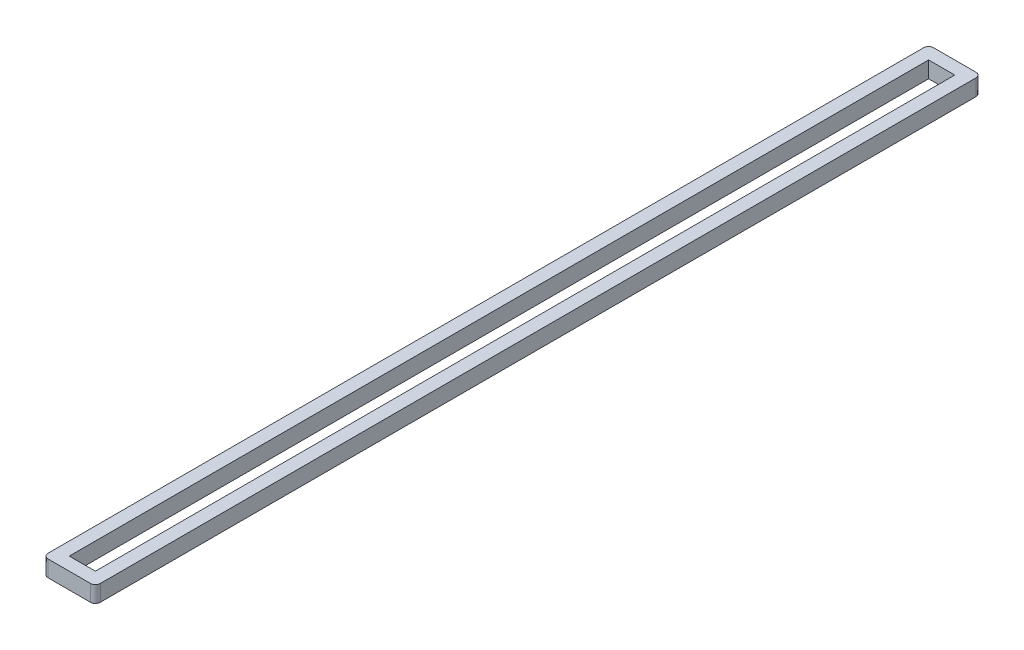
ISO-10303-21;
HEADER;
FILE_DESCRIPTION(('STEP AP214'),'2;1');
FILE_NAME('part.step','',(''),(''),'','','');
FILE_SCHEMA(('AUTOMOTIVE_DESIGN { 1 0 10303 214 1 1 1 1 }'));
ENDSEC;
DATA;
#1=APPLICATION_CONTEXT('core data for automotive mechanical design processes');
#2=APPLICATION_PROTOCOL_DEFINITION('international standard','automotive_design',2000,#1);
#3=PRODUCT_CONTEXT('',#1,'mechanical');
#4=PRODUCT('Part','Part','',(#3));
#5=PRODUCT_RELATED_PRODUCT_CATEGORY('part','',(#4));
#6=PRODUCT_DEFINITION_FORMATION('','',#4);
#7=PRODUCT_DEFINITION_CONTEXT('part definition',#1,'design');
#8=PRODUCT_DEFINITION('design','',#6,#7);
#9=PRODUCT_DEFINITION_SHAPE('','',#8);
#10=(LENGTH_UNIT() NAMED_UNIT(*) SI_UNIT(.MILLI.,.METRE.));
#11=(NAMED_UNIT(*) PLANE_ANGLE_UNIT() SI_UNIT($,.RADIAN.));
#12=(NAMED_UNIT(*) SI_UNIT($,.STERADIAN.) SOLID_ANGLE_UNIT());
#13=UNCERTAINTY_MEASURE_WITH_UNIT(LENGTH_MEASURE(1.E-05),#10,'distance_accuracy_value','');
#14=(GEOMETRIC_REPRESENTATION_CONTEXT(3) GLOBAL_UNCERTAINTY_ASSIGNED_CONTEXT((#13)) GLOBAL_UNIT_ASSIGNED_CONTEXT((#10,
#11,#12)) REPRESENTATION_CONTEXT('',''));
#15=CARTESIAN_POINT('',(0.,0.,0.));
#16=DIRECTION('',(0.,0.,1.));
#17=DIRECTION('',(1.,0.,0.));
#18=AXIS2_PLACEMENT_3D('',#15,#16,#17);
#19=CARTESIAN_POINT('',(0.,5.,0.));
#20=DIRECTION('',(0.,-1.,0.));
#21=DIRECTION('',(0.,0.,-1.));
#22=AXIS2_PLACEMENT_3D('',#19,#20,#21);
#23=PLANE('',#22);
#24=DIRECTION('',(1.,0.,0.));
#25=VECTOR('',#24,1.);
#26=CARTESIAN_POINT('',(-8.00000000000001,5.,135.5));
#27=LINE('',#26,#25);
#28=CARTESIAN_POINT('',(-6.50000000000001,5.,135.5));
#29=VERTEX_POINT('',#28);
#30=CARTESIAN_POINT('',(6.49999999999999,5.,135.5));
#31=VERTEX_POINT('',#30);
#32=EDGE_CURVE('E175',#29,#31,#27,.T.);
#33=ORIENTED_EDGE('',*,*,#32,.T.);
#34=CARTESIAN_POINT('',(6.49999999999999,5.,134.));
#35=DIRECTION('',(0.,-1.,0.));
#36=DIRECTION('',(0.,0.,-1.));
#37=AXIS2_PLACEMENT_3D('',#34,#35,#36);
#38=CIRCLE('',#37,1.5);
#39=CARTESIAN_POINT('',(7.99999999999999,5.,134.));
#40=VERTEX_POINT('',#39);
#41=EDGE_CURVE('E210',#31,#40,#38,.F.);
#42=ORIENTED_EDGE('',*,*,#41,.T.);
#43=DIRECTION('',(0.,0.,-1.));
#44=VECTOR('',#43,1.);
#45=CARTESIAN_POINT('',(7.99999999999999,5.,135.5));
#46=LINE('',#45,#44);
#47=CARTESIAN_POINT('',(7.99999999999999,5.,-134.));
#48=VERTEX_POINT('',#47);
#49=EDGE_CURVE('E167',#40,#48,#46,.T.);
#50=ORIENTED_EDGE('',*,*,#49,.T.);
#51=CARTESIAN_POINT('',(6.49999999999999,5.,-134.));
#52=DIRECTION('',(0.,-1.,0.));
#53=DIRECTION('',(0.,0.,-1.));
#54=AXIS2_PLACEMENT_3D('',#51,#52,#53);
#55=CIRCLE('',#54,1.5);
#56=CARTESIAN_POINT('',(6.49999999999999,5.,-135.5));
#57=VERTEX_POINT('',#56);
#58=EDGE_CURVE('E205',#48,#57,#55,.F.);
#59=ORIENTED_EDGE('',*,*,#58,.T.);
#60=DIRECTION('',(-1.,0.,0.));
#61=VECTOR('',#60,1.);
#62=CARTESIAN_POINT('',(-8.00000000000001,5.,-135.5));
#63=LINE('',#62,#61);
#64=CARTESIAN_POINT('',(-6.50000000000001,5.,-135.5));
#65=VERTEX_POINT('',#64);
#66=EDGE_CURVE('E170',#57,#65,#63,.T.);
#67=ORIENTED_EDGE('',*,*,#66,.T.);
#68=CARTESIAN_POINT('',(-6.50000000000001,5.,-134.));
#69=DIRECTION('',(0.,-1.,0.));
#70=DIRECTION('',(0.,0.,-1.));
#71=AXIS2_PLACEMENT_3D('',#68,#69,#70);
#72=CIRCLE('',#71,1.5);
#73=CARTESIAN_POINT('',(-8.00000000000001,5.,-134.));
#74=VERTEX_POINT('',#73);
#75=EDGE_CURVE('E57',#65,#74,#72,.F.);
#76=ORIENTED_EDGE('',*,*,#75,.T.);
#77=DIRECTION('',(0.,0.,1.));
#78=VECTOR('',#77,1.);
#79=CARTESIAN_POINT('',(-8.00000000000001,5.,135.5));
#80=LINE('',#79,#78);
#81=CARTESIAN_POINT('',(-8.00000000000001,5.,134.));
#82=VERTEX_POINT('',#81);
#83=EDGE_CURVE('E173',#74,#82,#80,.T.);
#84=ORIENTED_EDGE('',*,*,#83,.T.);
#85=CARTESIAN_POINT('',(-6.50000000000001,5.,134.));
#86=DIRECTION('',(0.,-1.,0.));
#87=DIRECTION('',(0.,0.,-1.));
#88=AXIS2_PLACEMENT_3D('',#85,#86,#87);
#89=CIRCLE('',#88,1.5);
#90=EDGE_CURVE('E208',#82,#29,#89,.F.);
#91=ORIENTED_EDGE('',*,*,#90,.T.);
#92=EDGE_LOOP('',(#33,#42,#50,#59,#67,#76,#84,#91));
#93=FACE_BOUND('',#92,.T.);
#94=DIRECTION('',(0.,0.,-1.));
#95=VECTOR('',#94,1.);
#96=CARTESIAN_POINT('',(4.,5.,131.5));
#97=LINE('',#96,#95);
#98=CARTESIAN_POINT('',(4.,5.,131.5));
#99=VERTEX_POINT('',#98);
#100=CARTESIAN_POINT('',(4.,5.,-131.5));
#101=VERTEX_POINT('',#100);
#102=EDGE_CURVE('E126',#99,#101,#97,.T.);
#103=ORIENTED_EDGE('',*,*,#102,.F.);
#104=DIRECTION('',(1.,0.,0.));
#105=VECTOR('',#104,1.);
#106=CARTESIAN_POINT('',(-3.99999999999999,5.,131.5));
#107=LINE('',#106,#105);
#108=CARTESIAN_POINT('',(-3.99999999999999,5.,131.5));
#109=VERTEX_POINT('',#108);
#110=EDGE_CURVE('E151',#109,#99,#107,.T.);
#111=ORIENTED_EDGE('',*,*,#110,.F.);
#112=DIRECTION('',(0.,0.,1.));
#113=VECTOR('',#112,1.);
#114=CARTESIAN_POINT('',(-3.99999999999999,5.,131.5));
#115=LINE('',#114,#113);
#116=CARTESIAN_POINT('',(-3.99999999999999,5.,-131.5));
#117=VERTEX_POINT('',#116);
#118=EDGE_CURVE('E149',#117,#109,#115,.T.);
#119=ORIENTED_EDGE('',*,*,#118,.F.);
#120=DIRECTION('',(-1.,0.,0.));
#121=VECTOR('',#120,1.);
#122=CARTESIAN_POINT('',(-3.99999999999999,5.,-131.5));
#123=LINE('',#122,#121);
#124=EDGE_CURVE('E136',#101,#117,#123,.T.);
#125=ORIENTED_EDGE('',*,*,#124,.F.);
#126=EDGE_LOOP('',(#103,#111,#119,#125));
#127=FACE_BOUND('',#126,.T.);
#128=ADVANCED_FACE('F35',(#93,#127),#23,.F.);
#129=CARTESIAN_POINT('',(0.,0.,0.));
#130=DIRECTION('',(0.,-1.,0.));
#131=DIRECTION('',(0.,0.,-1.));
#132=AXIS2_PLACEMENT_3D('',#129,#130,#131);
#133=PLANE('',#132);
#134=DIRECTION('',(0.,0.,-1.));
#135=VECTOR('',#134,1.);
#136=CARTESIAN_POINT('',(7.99999999999999,0.,135.5));
#137=LINE('',#136,#135);
#138=CARTESIAN_POINT('',(7.99999999999999,0.,134.));
#139=VERTEX_POINT('',#138);
#140=CARTESIAN_POINT('',(7.99999999999999,0.,-134.));
#141=VERTEX_POINT('',#140);
#142=EDGE_CURVE('E144',#139,#141,#137,.T.);
#143=ORIENTED_EDGE('',*,*,#142,.F.);
#144=CARTESIAN_POINT('',(6.49999999999999,0.,134.));
#145=DIRECTION('',(0.,-1.,0.));
#146=DIRECTION('',(0.,0.,-1.));
#147=AXIS2_PLACEMENT_3D('',#144,#145,#146);
#148=CIRCLE('',#147,1.5);
#149=CARTESIAN_POINT('',(6.49999999999999,0.,135.5));
#150=VERTEX_POINT('',#149);
#151=EDGE_CURVE('E198',#139,#150,#148,.T.);
#152=ORIENTED_EDGE('',*,*,#151,.T.);
#153=DIRECTION('',(1.,0.,0.));
#154=VECTOR('',#153,1.);
#155=CARTESIAN_POINT('',(-8.00000000000001,0.,135.5));
#156=LINE('',#155,#154);
#157=CARTESIAN_POINT('',(-6.50000000000001,0.,135.5));
#158=VERTEX_POINT('',#157);
#159=EDGE_CURVE('E171',#158,#150,#156,.T.);
#160=ORIENTED_EDGE('',*,*,#159,.F.);
#161=CARTESIAN_POINT('',(-6.50000000000001,0.,134.));
#162=DIRECTION('',(0.,-1.,0.));
#163=DIRECTION('',(0.,0.,-1.));
#164=AXIS2_PLACEMENT_3D('',#161,#162,#163);
#165=CIRCLE('',#164,1.5);
#166=CARTESIAN_POINT('',(-8.00000000000001,0.,134.));
#167=VERTEX_POINT('',#166);
#168=EDGE_CURVE('E196',#158,#167,#165,.T.);
#169=ORIENTED_EDGE('',*,*,#168,.T.);
#170=DIRECTION('',(0.,0.,1.));
#171=VECTOR('',#170,1.);
#172=CARTESIAN_POINT('',(-8.00000000000001,0.,135.5));
#173=LINE('',#172,#171);
#174=CARTESIAN_POINT('',(-8.00000000000001,0.,-134.));
#175=VERTEX_POINT('',#174);
#176=EDGE_CURVE('E184',#175,#167,#173,.T.);
#177=ORIENTED_EDGE('',*,*,#176,.F.);
#178=CARTESIAN_POINT('',(-6.50000000000001,0.,-134.));
#179=DIRECTION('',(0.,-1.,0.));
#180=DIRECTION('',(0.,0.,-1.));
#181=AXIS2_PLACEMENT_3D('',#178,#179,#180);
#182=CIRCLE('',#181,1.5);
#183=CARTESIAN_POINT('',(-6.50000000000001,0.,-135.5));
#184=VERTEX_POINT('',#183);
#185=EDGE_CURVE('E194',#175,#184,#182,.T.);
#186=ORIENTED_EDGE('',*,*,#185,.T.);
#187=DIRECTION('',(-1.,0.,0.));
#188=VECTOR('',#187,1.);
#189=CARTESIAN_POINT('',(-8.00000000000001,0.,-135.5));
#190=LINE('',#189,#188);
#191=CARTESIAN_POINT('',(6.49999999999999,0.,-135.5));
#192=VERTEX_POINT('',#191);
#193=EDGE_CURVE('E181',#192,#184,#190,.T.);
#194=ORIENTED_EDGE('',*,*,#193,.F.);
#195=CARTESIAN_POINT('',(6.49999999999999,0.,-134.));
#196=DIRECTION('',(0.,-1.,0.));
#197=DIRECTION('',(0.,0.,-1.));
#198=AXIS2_PLACEMENT_3D('',#195,#196,#197);
#199=CIRCLE('',#198,1.5);
#200=EDGE_CURVE('E192',#192,#141,#199,.T.);
#201=ORIENTED_EDGE('',*,*,#200,.T.);
#202=EDGE_LOOP('',(#143,#152,#160,#169,#177,#186,#194,#201));
#203=FACE_BOUND('',#202,.T.);
#204=DIRECTION('',(1.,0.,0.));
#205=VECTOR('',#204,1.);
#206=CARTESIAN_POINT('',(-3.99999999999999,0.,131.5));
#207=LINE('',#206,#205);
#208=CARTESIAN_POINT('',(-3.99999999999999,0.,131.5));
#209=VERTEX_POINT('',#208);
#210=CARTESIAN_POINT('',(4.,0.,131.5));
#211=VERTEX_POINT('',#210);
#212=EDGE_CURVE('E137',#209,#211,#207,.T.);
#213=ORIENTED_EDGE('',*,*,#212,.T.);
#214=DIRECTION('',(0.,0.,-1.));
#215=VECTOR('',#214,1.);
#216=CARTESIAN_POINT('',(4.,0.,131.5));
#217=LINE('',#216,#215);
#218=CARTESIAN_POINT('',(4.,0.,-131.5));
#219=VERTEX_POINT('',#218);
#220=EDGE_CURVE('E155',#211,#219,#217,.T.);
#221=ORIENTED_EDGE('',*,*,#220,.T.);
#222=DIRECTION('',(-1.,0.,0.));
#223=VECTOR('',#222,1.);
#224=CARTESIAN_POINT('',(-3.99999999999999,0.,-131.5));
#225=LINE('',#224,#223);
#226=CARTESIAN_POINT('',(-3.99999999999999,0.,-131.5));
#227=VERTEX_POINT('',#226);
#228=EDGE_CURVE('E143',#219,#227,#225,.T.);
#229=ORIENTED_EDGE('',*,*,#228,.T.);
#230=DIRECTION('',(0.,0.,1.));
#231=VECTOR('',#230,1.);
#232=CARTESIAN_POINT('',(-3.99999999999999,0.,131.5));
#233=LINE('',#232,#231);
#234=EDGE_CURVE('E158',#227,#209,#233,.T.);
#235=ORIENTED_EDGE('',*,*,#234,.T.);
#236=EDGE_LOOP('',(#213,#221,#229,#235));
#237=FACE_BOUND('',#236,.T.);
#238=ADVANCED_FACE('F226',(#203,#237),#133,.T.);
#239=CARTESIAN_POINT('',(7.99999999999999,5.,135.5));
#240=DIRECTION('',(-1.,0.,0.));
#241=DIRECTION('',(0.,0.,1.));
#242=AXIS2_PLACEMENT_3D('',#239,#240,#241);
#243=PLANE('',#242);
#244=ORIENTED_EDGE('',*,*,#49,.F.);
#245=DIRECTION('',(0.,-1.,0.));
#246=VECTOR('',#245,1.);
#247=CARTESIAN_POINT('',(7.99999999999999,5.,134.));
#248=LINE('',#247,#246);
#249=EDGE_CURVE('E189',#40,#139,#248,.T.);
#250=ORIENTED_EDGE('',*,*,#249,.T.);
#251=ORIENTED_EDGE('',*,*,#142,.T.);
#252=DIRECTION('',(0.,-1.,0.));
#253=VECTOR('',#252,1.);
#254=CARTESIAN_POINT('',(7.99999999999999,5.,-134.));
#255=LINE('',#254,#253);
#256=EDGE_CURVE('E178',#141,#48,#255,.F.);
#257=ORIENTED_EDGE('',*,*,#256,.T.);
#258=EDGE_LOOP('',(#244,#250,#251,#257));
#259=FACE_BOUND('',#258,.T.);
#260=ADVANCED_FACE('F248',(#259),#243,.F.);
#261=CARTESIAN_POINT('',(-8.00000000000001,5.,-135.5));
#262=DIRECTION('',(0.,0.,1.));
#263=DIRECTION('',(1.,0.,0.));
#264=AXIS2_PLACEMENT_3D('',#261,#262,#263);
#265=PLANE('',#264);
#266=ORIENTED_EDGE('',*,*,#193,.T.);
#267=DIRECTION('',(0.,-1.,0.));
#268=VECTOR('',#267,1.);
#269=CARTESIAN_POINT('',(-6.50000000000001,5.,-135.5));
#270=LINE('',#269,#268);
#271=EDGE_CURVE('E11',#184,#65,#270,.F.);
#272=ORIENTED_EDGE('',*,*,#271,.T.);
#273=ORIENTED_EDGE('',*,*,#66,.F.);
#274=DIRECTION('',(0.,-1.,0.));
#275=VECTOR('',#274,1.);
#276=CARTESIAN_POINT('',(6.49999999999999,5.,-135.5));
#277=LINE('',#276,#275);
#278=EDGE_CURVE('E43',#57,#192,#277,.T.);
#279=ORIENTED_EDGE('',*,*,#278,.T.);
#280=EDGE_LOOP('',(#266,#272,#273,#279));
#281=FACE_BOUND('',#280,.T.);
#282=ADVANCED_FACE('F220',(#281),#265,.F.);
#283=CARTESIAN_POINT('',(-8.00000000000001,5.,135.5));
#284=DIRECTION('',(1.,0.,0.));
#285=DIRECTION('',(0.,0.,-1.));
#286=AXIS2_PLACEMENT_3D('',#283,#284,#285);
#287=PLANE('',#286);
#288=ORIENTED_EDGE('',*,*,#176,.T.);
#289=DIRECTION('',(0.,-1.,0.));
#290=VECTOR('',#289,1.);
#291=CARTESIAN_POINT('',(-8.00000000000001,5.,134.));
#292=LINE('',#291,#290);
#293=EDGE_CURVE('E50',#167,#82,#292,.F.);
#294=ORIENTED_EDGE('',*,*,#293,.T.);
#295=ORIENTED_EDGE('',*,*,#83,.F.);
#296=DIRECTION('',(0.,-1.,0.));
#297=VECTOR('',#296,1.);
#298=CARTESIAN_POINT('',(-8.00000000000001,5.,-134.));
#299=LINE('',#298,#297);
#300=EDGE_CURVE('E212',#74,#175,#299,.T.);
#301=ORIENTED_EDGE('',*,*,#300,.T.);
#302=EDGE_LOOP('',(#288,#294,#295,#301));
#303=FACE_BOUND('',#302,.T.);
#304=ADVANCED_FACE('F232',(#303),#287,.F.);
#305=CARTESIAN_POINT('',(-8.00000000000001,5.,135.5));
#306=DIRECTION('',(0.,0.,-1.));
#307=DIRECTION('',(-1.,0.,0.));
#308=AXIS2_PLACEMENT_3D('',#305,#306,#307);
#309=PLANE('',#308);
#310=ORIENTED_EDGE('',*,*,#159,.T.);
#311=DIRECTION('',(0.,-1.,0.));
#312=VECTOR('',#311,1.);
#313=CARTESIAN_POINT('',(6.49999999999999,5.,135.5));
#314=LINE('',#313,#312);
#315=EDGE_CURVE('E203',#150,#31,#314,.F.);
#316=ORIENTED_EDGE('',*,*,#315,.T.);
#317=ORIENTED_EDGE('',*,*,#32,.F.);
#318=DIRECTION('',(0.,-1.,0.));
#319=VECTOR('',#318,1.);
#320=CARTESIAN_POINT('',(-6.50000000000001,5.,135.5));
#321=LINE('',#320,#319);
#322=EDGE_CURVE('E200',#29,#158,#321,.T.);
#323=ORIENTED_EDGE('',*,*,#322,.T.);
#324=EDGE_LOOP('',(#310,#316,#317,#323));
#325=FACE_BOUND('',#324,.T.);
#326=ADVANCED_FACE('F240',(#325),#309,.F.);
#327=CARTESIAN_POINT('',(4.,5.,131.5));
#328=DIRECTION('',(-1.,0.,0.));
#329=DIRECTION('',(0.,0.,1.));
#330=AXIS2_PLACEMENT_3D('',#327,#328,#329);
#331=PLANE('',#330);
#332=ORIENTED_EDGE('',*,*,#220,.F.);
#333=DIRECTION('',(0.,-1.,0.));
#334=VECTOR('',#333,1.);
#335=CARTESIAN_POINT('',(4.,5.,131.5));
#336=LINE('',#335,#334);
#337=EDGE_CURVE('E132',#99,#211,#336,.T.);
#338=ORIENTED_EDGE('',*,*,#337,.F.);
#339=ORIENTED_EDGE('',*,*,#102,.T.);
#340=DIRECTION('',(0.,-1.,0.));
#341=VECTOR('',#340,1.);
#342=CARTESIAN_POINT('',(4.,5.,-131.5));
#343=LINE('',#342,#341);
#344=EDGE_CURVE('E129',#101,#219,#343,.T.);
#345=ORIENTED_EDGE('',*,*,#344,.T.);
#346=EDGE_LOOP('',(#332,#338,#339,#345));
#347=FACE_BOUND('',#346,.T.);
#348=ADVANCED_FACE('F128',(#347),#331,.T.);
#349=CARTESIAN_POINT('',(-3.99999999999999,5.,-131.5));
#350=DIRECTION('',(0.,0.,1.));
#351=DIRECTION('',(1.,0.,0.));
#352=AXIS2_PLACEMENT_3D('',#349,#350,#351);
#353=PLANE('',#352);
#354=ORIENTED_EDGE('',*,*,#228,.F.);
#355=ORIENTED_EDGE('',*,*,#344,.F.);
#356=ORIENTED_EDGE('',*,*,#124,.T.);
#357=DIRECTION('',(0.,-1.,0.));
#358=VECTOR('',#357,1.);
#359=CARTESIAN_POINT('',(-3.99999999999999,5.,-131.5));
#360=LINE('',#359,#358);
#361=EDGE_CURVE('E145',#117,#227,#360,.T.);
#362=ORIENTED_EDGE('',*,*,#361,.T.);
#363=EDGE_LOOP('',(#354,#355,#356,#362));
#364=FACE_BOUND('',#363,.T.);
#365=ADVANCED_FACE('F140',(#364),#353,.T.);
#366=CARTESIAN_POINT('',(-3.99999999999999,5.,131.5));
#367=DIRECTION('',(1.,0.,0.));
#368=DIRECTION('',(0.,0.,-1.));
#369=AXIS2_PLACEMENT_3D('',#366,#367,#368);
#370=PLANE('',#369);
#371=ORIENTED_EDGE('',*,*,#234,.F.);
#372=ORIENTED_EDGE('',*,*,#361,.F.);
#373=ORIENTED_EDGE('',*,*,#118,.T.);
#374=DIRECTION('',(0.,-1.,0.));
#375=VECTOR('',#374,1.);
#376=CARTESIAN_POINT('',(-3.99999999999999,5.,131.5));
#377=LINE('',#376,#375);
#378=EDGE_CURVE('E164',#109,#209,#377,.T.);
#379=ORIENTED_EDGE('',*,*,#378,.T.);
#380=EDGE_LOOP('',(#371,#372,#373,#379));
#381=FACE_BOUND('',#380,.T.);
#382=ADVANCED_FACE('F303',(#381),#370,.T.);
#383=CARTESIAN_POINT('',(-3.99999999999999,5.,131.5));
#384=DIRECTION('',(0.,0.,-1.));
#385=DIRECTION('',(-1.,0.,0.));
#386=AXIS2_PLACEMENT_3D('',#383,#384,#385);
#387=PLANE('',#386);
#388=ORIENTED_EDGE('',*,*,#212,.F.);
#389=ORIENTED_EDGE('',*,*,#378,.F.);
#390=ORIENTED_EDGE('',*,*,#110,.T.);
#391=ORIENTED_EDGE('',*,*,#337,.T.);
#392=EDGE_LOOP('',(#388,#389,#390,#391));
#393=FACE_BOUND('',#392,.T.);
#394=ADVANCED_FACE('F274',(#393),#387,.T.);
#395=CARTESIAN_POINT('',(6.49999999999999,5.,134.));
#396=DIRECTION('',(0.,-1.,0.));
#397=DIRECTION('',(0.,0.,-1.));
#398=AXIS2_PLACEMENT_3D('',#395,#396,#397);
#399=CYLINDRICAL_SURFACE('',#398,1.5);
#400=ORIENTED_EDGE('',*,*,#41,.F.);
#401=ORIENTED_EDGE('',*,*,#315,.F.);
#402=ORIENTED_EDGE('',*,*,#151,.F.);
#403=ORIENTED_EDGE('',*,*,#249,.F.);
#404=EDGE_LOOP('',(#400,#401,#402,#403));
#405=FACE_BOUND('',#404,.T.);
#406=ADVANCED_FACE('F245',(#405),#399,.T.);
#407=CARTESIAN_POINT('',(-6.50000000000001,5.,134.));
#408=DIRECTION('',(0.,-1.,0.));
#409=DIRECTION('',(0.,0.,-1.));
#410=AXIS2_PLACEMENT_3D('',#407,#408,#409);
#411=CYLINDRICAL_SURFACE('',#410,1.5);
#412=ORIENTED_EDGE('',*,*,#90,.F.);
#413=ORIENTED_EDGE('',*,*,#293,.F.);
#414=ORIENTED_EDGE('',*,*,#168,.F.);
#415=ORIENTED_EDGE('',*,*,#322,.F.);
#416=EDGE_LOOP('',(#412,#413,#414,#415));
#417=FACE_BOUND('',#416,.T.);
#418=ADVANCED_FACE('F237',(#417),#411,.T.);
#419=CARTESIAN_POINT('',(-6.50000000000001,5.,-134.));
#420=DIRECTION('',(0.,-1.,0.));
#421=DIRECTION('',(0.,0.,-1.));
#422=AXIS2_PLACEMENT_3D('',#419,#420,#421);
#423=CYLINDRICAL_SURFACE('',#422,1.5);
#424=ORIENTED_EDGE('',*,*,#75,.F.);
#425=ORIENTED_EDGE('',*,*,#271,.F.);
#426=ORIENTED_EDGE('',*,*,#185,.F.);
#427=ORIENTED_EDGE('',*,*,#300,.F.);
#428=EDGE_LOOP('',(#424,#425,#426,#427));
#429=FACE_BOUND('',#428,.T.);
#430=ADVANCED_FACE('F231',(#429),#423,.T.);
#431=CARTESIAN_POINT('',(6.49999999999999,5.,-134.));
#432=DIRECTION('',(0.,-1.,0.));
#433=DIRECTION('',(0.,0.,-1.));
#434=AXIS2_PLACEMENT_3D('',#431,#432,#433);
#435=CYLINDRICAL_SURFACE('',#434,1.5);
#436=ORIENTED_EDGE('',*,*,#58,.F.);
#437=ORIENTED_EDGE('',*,*,#256,.F.);
#438=ORIENTED_EDGE('',*,*,#200,.F.);
#439=ORIENTED_EDGE('',*,*,#278,.F.);
#440=EDGE_LOOP('',(#436,#437,#438,#439));
#441=FACE_BOUND('',#440,.T.);
#442=ADVANCED_FACE('F37',(#441),#435,.T.);
#443=CLOSED_SHELL('',(#128,#238,#260,#282,#304,#326,#348,#365,#382,#394,#406,#418,#430,#442));
#444=MANIFOLD_SOLID_BREP('B2',#443);
#445=ADVANCED_BREP_SHAPE_REPRESENTATION('',(#18,#444),#14);
#446=SHAPE_DEFINITION_REPRESENTATION(#9,#445);
ENDSEC;
END-ISO-10303-21;
